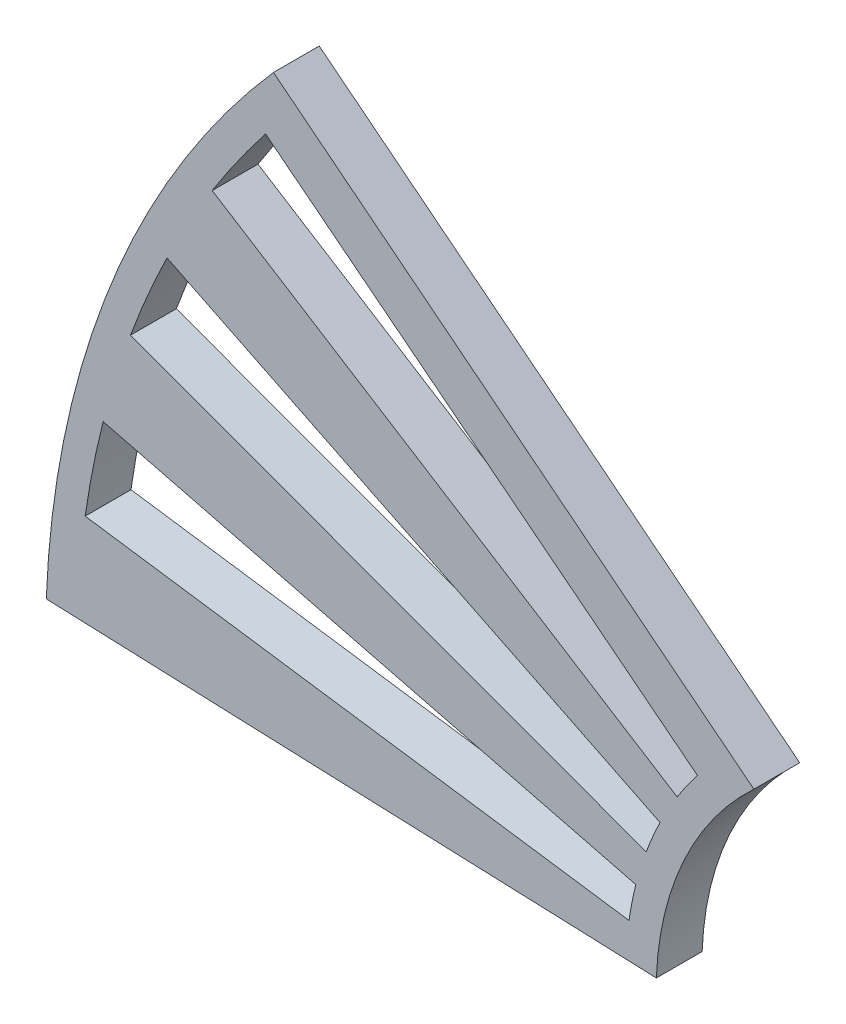
ISO-10303-21;
HEADER;
FILE_DESCRIPTION(('STEP AP214'),'2;1');
FILE_NAME('part.step','',(''),(''),'','','');
FILE_SCHEMA(('AUTOMOTIVE_DESIGN { 1 0 10303 214 1 1 1 1 }'));
ENDSEC;
DATA;
#1=APPLICATION_CONTEXT('core data for automotive mechanical design processes');
#2=APPLICATION_PROTOCOL_DEFINITION('international standard','automotive_design',2000,#1);
#3=PRODUCT_CONTEXT('',#1,'mechanical');
#4=PRODUCT('Part','Part','',(#3));
#5=PRODUCT_RELATED_PRODUCT_CATEGORY('part','',(#4));
#6=PRODUCT_DEFINITION_FORMATION('','',#4);
#7=PRODUCT_DEFINITION_CONTEXT('part definition',#1,'design');
#8=PRODUCT_DEFINITION('design','',#6,#7);
#9=PRODUCT_DEFINITION_SHAPE('','',#8);
#10=(LENGTH_UNIT() NAMED_UNIT(*) SI_UNIT(.MILLI.,.METRE.));
#11=(NAMED_UNIT(*) PLANE_ANGLE_UNIT() SI_UNIT($,.RADIAN.));
#12=(NAMED_UNIT(*) SI_UNIT($,.STERADIAN.) SOLID_ANGLE_UNIT());
#13=UNCERTAINTY_MEASURE_WITH_UNIT(LENGTH_MEASURE(1.E-05),#10,'distance_accuracy_value','');
#14=(GEOMETRIC_REPRESENTATION_CONTEXT(3) GLOBAL_UNCERTAINTY_ASSIGNED_CONTEXT((#13)) GLOBAL_UNIT_ASSIGNED_CONTEXT((#10,
#11,#12)) REPRESENTATION_CONTEXT('',''));
#15=CARTESIAN_POINT('',(0.,0.,0.));
#16=DIRECTION('',(0.,0.,1.));
#17=DIRECTION('',(1.,0.,0.));
#18=AXIS2_PLACEMENT_3D('',#15,#16,#17);
#19=CARTESIAN_POINT('',(0.,0.,3.));
#20=DIRECTION('',(0.,0.,-1.));
#21=DIRECTION('',(-1.,0.,0.));
#22=AXIS2_PLACEMENT_3D('',#19,#20,#21);
#23=CYLINDRICAL_SURFACE('',#22,20.);
#24=CARTESIAN_POINT('',(0.,0.,0.));
#25=DIRECTION('',(0.,0.,1.));
#26=DIRECTION('',(1.,0.,0.));
#27=AXIS2_PLACEMENT_3D('',#24,#25,#26);
#28=CIRCLE('',#27,20.);
#29=CARTESIAN_POINT('',(-13.592462365831,14.671229220262,0.));
#30=VERTEX_POINT('',#29);
#31=CARTESIAN_POINT('',(-19.9854479818915,0.762803358087425,0.));
#32=VERTEX_POINT('',#31);
#33=EDGE_CURVE('E289',#30,#32,#28,.T.);
#34=ORIENTED_EDGE('',*,*,#33,.F.);
#35=DIRECTION('',(0.,0.,-1.));
#36=VECTOR('',#35,1.);
#37=CARTESIAN_POINT('',(-13.592462365831,14.671229220262,3.));
#38=LINE('',#37,#36);
#39=CARTESIAN_POINT('',(-13.592462365831,14.671229220262,3.));
#40=VERTEX_POINT('',#39);
#41=EDGE_CURVE('E11',#40,#30,#38,.T.);
#42=ORIENTED_EDGE('',*,*,#41,.F.);
#43=CARTESIAN_POINT('',(0.,0.,3.));
#44=DIRECTION('',(0.,0.,1.));
#45=DIRECTION('',(1.,0.,0.));
#46=AXIS2_PLACEMENT_3D('',#43,#44,#45);
#47=CIRCLE('',#46,20.);
#48=CARTESIAN_POINT('',(-19.9854479818915,0.762803358087425,3.));
#49=VERTEX_POINT('',#48);
#50=EDGE_CURVE('E290',#40,#49,#47,.T.);
#51=ORIENTED_EDGE('',*,*,#50,.T.);
#52=DIRECTION('',(0.,0.,-1.));
#53=VECTOR('',#52,1.);
#54=CARTESIAN_POINT('',(-19.9854479818915,0.762803358087425,3.));
#55=LINE('',#54,#53);
#56=EDGE_CURVE('E44',#49,#32,#55,.T.);
#57=ORIENTED_EDGE('',*,*,#56,.T.);
#58=EDGE_LOOP('',(#34,#42,#51,#57));
#59=FACE_BOUND('',#58,.T.);
#60=ADVANCED_FACE('F41',(#59),#23,.F.);
#61=CARTESIAN_POINT('',(-13.592462365831,14.671229220262,3.));
#62=DIRECTION('',(-0.620836450086055,-0.783940113940182,0.));
#63=DIRECTION('',(0.783940113940182,-0.620836450086055,0.));
#64=AXIS2_PLACEMENT_3D('',#61,#62,#63);
#65=PLANE('',#64);
#66=DIRECTION('',(-0.783940113940182,0.620836450086055,0.));
#67=VECTOR('',#66,1.);
#68=CARTESIAN_POINT('',(-13.592462365831,14.671229220262,0.));
#69=LINE('',#68,#67);
#70=CARTESIAN_POINT('',(-45.0736727010104,39.6025760430074,0.));
#71=VERTEX_POINT('',#70);
#72=EDGE_CURVE('E295',#30,#71,#69,.T.);
#73=ORIENTED_EDGE('',*,*,#72,.T.);
#74=DIRECTION('',(0.,0.,-1.));
#75=VECTOR('',#74,1.);
#76=CARTESIAN_POINT('',(-45.0736727010104,39.6025760430074,3.));
#77=LINE('',#76,#75);
#78=CARTESIAN_POINT('',(-45.0736727010104,39.6025760430074,3.));
#79=VERTEX_POINT('',#78);
#80=EDGE_CURVE('E50',#79,#71,#77,.T.);
#81=ORIENTED_EDGE('',*,*,#80,.F.);
#82=DIRECTION('',(-0.783940113940182,0.620836450086055,0.));
#83=VECTOR('',#82,1.);
#84=CARTESIAN_POINT('',(-13.592462365831,14.671229220262,3.));
#85=LINE('',#84,#83);
#86=EDGE_CURVE('E302',#40,#79,#85,.T.);
#87=ORIENTED_EDGE('',*,*,#86,.F.);
#88=ORIENTED_EDGE('',*,*,#41,.T.);
#89=EDGE_LOOP('',(#73,#81,#87,#88));
#90=FACE_BOUND('',#89,.T.);
#91=ADVANCED_FACE('F336',(#90),#65,.F.);
#92=CARTESIAN_POINT('',(0.,0.,3.));
#93=DIRECTION('',(0.,0.,-1.));
#94=DIRECTION('',(-1.,0.,0.));
#95=AXIS2_PLACEMENT_3D('',#92,#93,#94);
#96=CYLINDRICAL_SURFACE('',#95,60.);
#97=CARTESIAN_POINT('',(0.,0.,0.));
#98=DIRECTION('',(0.,0.,1.));
#99=DIRECTION('',(1.,0.,0.));
#100=AXIS2_PLACEMENT_3D('',#97,#98,#99);
#101=CIRCLE('',#100,60.);
#102=CARTESIAN_POINT('',(-59.9563439456744,2.28841007426227,0.));
#103=VERTEX_POINT('',#102);
#104=EDGE_CURVE('E312',#71,#103,#101,.T.);
#105=ORIENTED_EDGE('',*,*,#104,.T.);
#106=DIRECTION('',(0.,0.,-1.));
#107=VECTOR('',#106,1.);
#108=CARTESIAN_POINT('',(-59.9563439456744,2.28841007426227,3.));
#109=LINE('',#108,#107);
#110=CARTESIAN_POINT('',(-59.9563439456744,2.28841007426227,3.));
#111=VERTEX_POINT('',#110);
#112=EDGE_CURVE('E320',#111,#103,#109,.T.);
#113=ORIENTED_EDGE('',*,*,#112,.F.);
#114=CARTESIAN_POINT('',(0.,0.,3.));
#115=DIRECTION('',(0.,0.,1.));
#116=DIRECTION('',(1.,0.,0.));
#117=AXIS2_PLACEMENT_3D('',#114,#115,#116);
#118=CIRCLE('',#117,60.);
#119=EDGE_CURVE('E299',#79,#111,#118,.T.);
#120=ORIENTED_EDGE('',*,*,#119,.F.);
#121=ORIENTED_EDGE('',*,*,#80,.T.);
#122=EDGE_LOOP('',(#105,#113,#120,#121));
#123=FACE_BOUND('',#122,.T.);
#124=ADVANCED_FACE('F340',(#123),#96,.T.);
#125=CARTESIAN_POINT('',(-19.9854479818915,0.762803358087425,3.));
#126=DIRECTION('',(-0.0381401679043713,-0.999272399094574,0.));
#127=DIRECTION('',(0.999272399094575,-0.0381401679043713,0.));
#128=AXIS2_PLACEMENT_3D('',#125,#126,#127);
#129=PLANE('',#128);
#130=DIRECTION('',(-0.999272399094574,0.0381401679043713,0.));
#131=VECTOR('',#130,1.);
#132=CARTESIAN_POINT('',(-19.9854479818915,0.762803358087425,0.));
#133=LINE('',#132,#131);
#134=EDGE_CURVE('E308',#32,#103,#133,.T.);
#135=ORIENTED_EDGE('',*,*,#134,.F.);
#136=ORIENTED_EDGE('',*,*,#56,.F.);
#137=DIRECTION('',(-0.999272399094574,0.0381401679043713,0.));
#138=VECTOR('',#137,1.);
#139=CARTESIAN_POINT('',(-19.9854479818915,0.762803358087425,3.));
#140=LINE('',#139,#138);
#141=EDGE_CURVE('E294',#49,#111,#140,.T.);
#142=ORIENTED_EDGE('',*,*,#141,.T.);
#143=ORIENTED_EDGE('',*,*,#112,.T.);
#144=EDGE_LOOP('',(#135,#136,#142,#143));
#145=FACE_BOUND('',#144,.T.);
#146=ADVANCED_FACE('F330',(#145),#129,.T.);
#147=CARTESIAN_POINT('',(0.,0.,3.));
#148=DIRECTION('',(0.,0.,1.));
#149=DIRECTION('',(1.,0.,0.));
#150=AXIS2_PLACEMENT_3D('',#147,#148,#149);
#151=PLANE('',#150);
#152=CARTESIAN_POINT('',(0.,0.,3.));
#153=DIRECTION('',(0.,0.,1.));
#154=DIRECTION('',(1.,0.,0.));
#155=AXIS2_PLACEMENT_3D('',#152,#153,#154);
#156=CIRCLE('',#155,58.);
#157=CARTESIAN_POINT('',(-52.0473299222807,25.59444173959,3.));
#158=VERTEX_POINT('',#157);
#159=CARTESIAN_POINT('',(-54.4375568663973,20.0138052957893,3.));
#160=VERTEX_POINT('',#159);
#161=EDGE_CURVE('E58',#158,#160,#156,.T.);
#162=ORIENTED_EDGE('',*,*,#161,.F.);
#163=DIRECTION('',(-0.897367757280701,0.441283478268794,0.));
#164=VECTOR('',#163,1.);
#165=CARTESIAN_POINT('',(-52.0473299222807,25.59444173959,3.));
#166=LINE('',#165,#164);
#167=CARTESIAN_POINT('',(-19.7420906601754,9.70823652191346,3.));
#168=VERTEX_POINT('',#167);
#169=EDGE_CURVE('E226',#168,#158,#166,.T.);
#170=ORIENTED_EDGE('',*,*,#169,.F.);
#171=CARTESIAN_POINT('',(0.,0.,3.));
#172=DIRECTION('',(0.,0.,-1.));
#173=DIRECTION('',(-1.,0.,0.));
#174=AXIS2_PLACEMENT_3D('',#171,#172,#173);
#175=CIRCLE('',#174,22.);
#176=CARTESIAN_POINT('',(-20.6487284665645,7.59144338805802,3.));
#177=VERTEX_POINT('',#176);
#178=EDGE_CURVE('E222',#177,#168,#175,.T.);
#179=ORIENTED_EDGE('',*,*,#178,.F.);
#180=DIRECTION('',(0.938578566662022,-0.345065608548092,0.));
#181=VECTOR('',#180,1.);
#182=CARTESIAN_POINT('',(-20.6487284665645,7.59144338805802,3.));
#183=LINE('',#182,#181);
#184=EDGE_CURVE('E218',#160,#177,#183,.T.);
#185=ORIENTED_EDGE('',*,*,#184,.F.);
#186=EDGE_LOOP('',(#162,#170,#179,#185));
#187=FACE_BOUND('',#186,.T.);
#188=CARTESIAN_POINT('',(0.,0.,3.));
#189=DIRECTION('',(0.,0.,1.));
#190=DIRECTION('',(1.,0.,0.));
#191=AXIS2_PLACEMENT_3D('',#188,#189,#190);
#192=CIRCLE('',#191,58.);
#193=CARTESIAN_POINT('',(-45.5885872304648,35.8563901463923,3.));
#194=VERTEX_POINT('',#193);
#195=CARTESIAN_POINT('',(-49.0868615399316,30.8946601237104,3.));
#196=VERTEX_POINT('',#195);
#197=EDGE_CURVE('E66',#194,#196,#192,.T.);
#198=ORIENTED_EDGE('',*,*,#197,.F.);
#199=DIRECTION('',(-0.786010124663187,0.618213623213661,0.));
#200=VECTOR('',#199,1.);
#201=CARTESIAN_POINT('',(-45.5885872304648,35.8563901463923,3.));
#202=LINE('',#201,#200);
#203=CARTESIAN_POINT('',(-17.2922227425901,13.6006997107005,3.));
#204=VERTEX_POINT('',#203);
#205=EDGE_CURVE('E164',#204,#194,#202,.T.);
#206=ORIENTED_EDGE('',*,*,#205,.F.);
#207=CARTESIAN_POINT('',(0.,0.,3.));
#208=DIRECTION('',(0.,0.,-1.));
#209=DIRECTION('',(-1.,0.,0.));
#210=AXIS2_PLACEMENT_3D('',#207,#208,#209);
#211=CIRCLE('',#210,22.);
#212=CARTESIAN_POINT('',(-18.6191543772154,11.7186641848557,3.));
#213=VERTEX_POINT('',#212);
#214=EDGE_CURVE('E192',#213,#204,#211,.T.);
#215=ORIENTED_EDGE('',*,*,#214,.F.);
#216=DIRECTION('',(0.846325198964338,-0.532666553857077,0.));
#217=VECTOR('',#216,1.);
#218=CARTESIAN_POINT('',(-18.6191543772154,11.7186641848557,3.));
#219=LINE('',#218,#217);
#220=EDGE_CURVE('E184',#196,#213,#219,.T.);
#221=ORIENTED_EDGE('',*,*,#220,.F.);
#222=EDGE_LOOP('',(#198,#206,#215,#221));
#223=FACE_BOUND('',#222,.T.);
#224=CARTESIAN_POINT('',(0.,0.,3.));
#225=DIRECTION('',(0.,0.,-1.));
#226=DIRECTION('',(-1.,0.,0.));
#227=AXIS2_PLACEMENT_3D('',#224,#225,#226);
#228=CIRCLE('',#227,22.);
#229=CARTESIAN_POINT('',(-21.7758540383323,3.13244008741524,3.));
#230=VERTEX_POINT('',#229);
#231=CARTESIAN_POINT('',(-21.3291344828496,5.39147681183139,3.));
#232=VERTEX_POINT('',#231);
#233=EDGE_CURVE('E257',#230,#232,#228,.T.);
#234=ORIENTED_EDGE('',*,*,#233,.F.);
#235=DIRECTION('',(0.989811547196924,-0.142383640337056,0.));
#236=VECTOR('',#235,1.);
#237=CARTESIAN_POINT('',(-21.7758540383323,3.13244008741524,3.));
#238=LINE('',#237,#236);
#239=CARTESIAN_POINT('',(-57.4090697374216,8.25825113954927,3.));
#240=VERTEX_POINT('',#239);
#241=EDGE_CURVE('E268',#240,#230,#238,.T.);
#242=ORIENTED_EDGE('',*,*,#241,.F.);
#243=CARTESIAN_POINT('',(0.,0.,3.));
#244=DIRECTION('',(0.,0.,1.));
#245=DIRECTION('',(1.,0.,0.));
#246=AXIS2_PLACEMENT_3D('',#243,#244,#245);
#247=CIRCLE('',#246,58.);
#248=CARTESIAN_POINT('',(-56.2313545456944,14.21389341301,3.));
#249=VERTEX_POINT('',#248);
#250=EDGE_CURVE('E264',#249,#240,#247,.T.);
#251=ORIENTED_EDGE('',*,*,#250,.F.);
#252=DIRECTION('',(-0.969506112856801,0.245067127810517,0.));
#253=VECTOR('',#252,1.);
#254=CARTESIAN_POINT('',(-56.2313545456944,14.21389341301,3.));
#255=LINE('',#254,#253);
#256=EDGE_CURVE('E260',#232,#249,#255,.T.);
#257=ORIENTED_EDGE('',*,*,#256,.F.);
#258=EDGE_LOOP('',(#234,#242,#251,#257));
#259=FACE_BOUND('',#258,.T.);
#260=ORIENTED_EDGE('',*,*,#50,.F.);
#261=ORIENTED_EDGE('',*,*,#86,.T.);
#262=ORIENTED_EDGE('',*,*,#119,.T.);
#263=ORIENTED_EDGE('',*,*,#141,.F.);
#264=EDGE_LOOP('',(#260,#261,#262,#263));
#265=FACE_BOUND('',#264,.T.);
#266=ADVANCED_FACE('F342',(#187,#223,#259,#265),#151,.T.);
#267=CARTESIAN_POINT('',(0.,0.,0.));
#268=DIRECTION('',(0.,0.,1.));
#269=DIRECTION('',(1.,0.,0.));
#270=AXIS2_PLACEMENT_3D('',#267,#268,#269);
#271=PLANE('',#270);
#272=DIRECTION('',(0.897367757280701,-0.441283478268794,0.));
#273=VECTOR('',#272,1.);
#274=CARTESIAN_POINT('',(-52.0473299222807,25.59444173959,0.));
#275=LINE('',#274,#273);
#276=CARTESIAN_POINT('',(-52.0473299222807,25.59444173959,0.));
#277=VERTEX_POINT('',#276);
#278=CARTESIAN_POINT('',(-19.7420906601754,9.70823652191346,0.));
#279=VERTEX_POINT('',#278);
#280=EDGE_CURVE('E208',#277,#279,#275,.T.);
#281=ORIENTED_EDGE('',*,*,#280,.F.);
#282=CARTESIAN_POINT('',(0.,0.,0.));
#283=DIRECTION('',(0.,0.,1.));
#284=DIRECTION('',(1.,0.,0.));
#285=AXIS2_PLACEMENT_3D('',#282,#283,#284);
#286=CIRCLE('',#285,58.);
#287=CARTESIAN_POINT('',(-54.4375568663973,20.0138052957893,0.));
#288=VERTEX_POINT('',#287);
#289=EDGE_CURVE('E212',#288,#277,#286,.F.);
#290=ORIENTED_EDGE('',*,*,#289,.F.);
#291=DIRECTION('',(-0.938578566662022,0.345065608548092,0.));
#292=VECTOR('',#291,1.);
#293=CARTESIAN_POINT('',(-20.6487284665645,7.59144338805802,0.));
#294=LINE('',#293,#292);
#295=CARTESIAN_POINT('',(-20.6487284665645,7.59144338805802,0.));
#296=VERTEX_POINT('',#295);
#297=EDGE_CURVE('E234',#296,#288,#294,.T.);
#298=ORIENTED_EDGE('',*,*,#297,.F.);
#299=CARTESIAN_POINT('',(0.,0.,0.));
#300=DIRECTION('',(0.,0.,1.));
#301=DIRECTION('',(1.,0.,0.));
#302=AXIS2_PLACEMENT_3D('',#299,#300,#301);
#303=CIRCLE('',#302,22.);
#304=EDGE_CURVE('E173',#279,#296,#303,.T.);
#305=ORIENTED_EDGE('',*,*,#304,.F.);
#306=EDGE_LOOP('',(#281,#290,#298,#305));
#307=FACE_BOUND('',#306,.T.);
#308=DIRECTION('',(0.786010124663187,-0.618213623213661,0.));
#309=VECTOR('',#308,1.);
#310=CARTESIAN_POINT('',(-45.5885872304648,35.8563901463923,0.));
#311=LINE('',#310,#309);
#312=CARTESIAN_POINT('',(-45.5885872304648,35.8563901463923,0.));
#313=VERTEX_POINT('',#312);
#314=CARTESIAN_POINT('',(-17.2922227425901,13.6006997107005,0.));
#315=VERTEX_POINT('',#314);
#316=EDGE_CURVE('E179',#313,#315,#311,.T.);
#317=ORIENTED_EDGE('',*,*,#316,.F.);
#318=CARTESIAN_POINT('',(0.,0.,0.));
#319=DIRECTION('',(0.,0.,1.));
#320=DIRECTION('',(1.,0.,0.));
#321=AXIS2_PLACEMENT_3D('',#318,#319,#320);
#322=CIRCLE('',#321,58.);
#323=CARTESIAN_POINT('',(-49.0868615399316,30.8946601237105,0.));
#324=VERTEX_POINT('',#323);
#325=EDGE_CURVE('E157',#324,#313,#322,.F.);
#326=ORIENTED_EDGE('',*,*,#325,.F.);
#327=DIRECTION('',(-0.846325198964338,0.532666553857077,0.));
#328=VECTOR('',#327,1.);
#329=CARTESIAN_POINT('',(-18.6191543772154,11.7186641848557,0.));
#330=LINE('',#329,#328);
#331=CARTESIAN_POINT('',(-18.6191543772154,11.7186641848557,0.));
#332=VERTEX_POINT('',#331);
#333=EDGE_CURVE('E168',#332,#324,#330,.T.);
#334=ORIENTED_EDGE('',*,*,#333,.F.);
#335=CARTESIAN_POINT('',(0.,0.,0.));
#336=DIRECTION('',(0.,0.,1.));
#337=DIRECTION('',(1.,0.,0.));
#338=AXIS2_PLACEMENT_3D('',#335,#336,#337);
#339=CIRCLE('',#338,22.);
#340=EDGE_CURVE('E186',#315,#332,#339,.T.);
#341=ORIENTED_EDGE('',*,*,#340,.F.);
#342=EDGE_LOOP('',(#317,#326,#334,#341));
#343=FACE_BOUND('',#342,.T.);
#344=DIRECTION('',(-0.989811547196924,0.142383640337056,0.));
#345=VECTOR('',#344,1.);
#346=CARTESIAN_POINT('',(-21.7758540383323,3.13244008741524,0.));
#347=LINE('',#346,#345);
#348=CARTESIAN_POINT('',(-21.7758540383323,3.13244008741524,0.));
#349=VERTEX_POINT('',#348);
#350=CARTESIAN_POINT('',(-57.4090697374216,8.25825113954927,0.));
#351=VERTEX_POINT('',#350);
#352=EDGE_CURVE('E249',#349,#351,#347,.T.);
#353=ORIENTED_EDGE('',*,*,#352,.F.);
#354=CARTESIAN_POINT('',(0.,0.,0.));
#355=DIRECTION('',(0.,0.,1.));
#356=DIRECTION('',(1.,0.,0.));
#357=AXIS2_PLACEMENT_3D('',#354,#355,#356);
#358=CIRCLE('',#357,22.);
#359=CARTESIAN_POINT('',(-21.3291344828496,5.39147681183138,0.));
#360=VERTEX_POINT('',#359);
#361=EDGE_CURVE('E253',#360,#349,#358,.T.);
#362=ORIENTED_EDGE('',*,*,#361,.F.);
#363=DIRECTION('',(0.969506112856801,-0.245067127810517,0.));
#364=VECTOR('',#363,1.);
#365=CARTESIAN_POINT('',(-56.2313545456944,14.21389341301,0.));
#366=LINE('',#365,#364);
#367=CARTESIAN_POINT('',(-56.2313545456944,14.21389341301,0.));
#368=VERTEX_POINT('',#367);
#369=EDGE_CURVE('E276',#368,#360,#366,.T.);
#370=ORIENTED_EDGE('',*,*,#369,.F.);
#371=CARTESIAN_POINT('',(0.,0.,0.));
#372=DIRECTION('',(0.,0.,1.));
#373=DIRECTION('',(1.,0.,0.));
#374=AXIS2_PLACEMENT_3D('',#371,#372,#373);
#375=CIRCLE('',#374,58.);
#376=EDGE_CURVE('E246',#351,#368,#375,.F.);
#377=ORIENTED_EDGE('',*,*,#376,.F.);
#378=EDGE_LOOP('',(#353,#362,#370,#377));
#379=FACE_BOUND('',#378,.T.);
#380=ORIENTED_EDGE('',*,*,#33,.T.);
#381=ORIENTED_EDGE('',*,*,#134,.T.);
#382=ORIENTED_EDGE('',*,*,#104,.F.);
#383=ORIENTED_EDGE('',*,*,#72,.F.);
#384=EDGE_LOOP('',(#380,#381,#382,#383));
#385=FACE_BOUND('',#384,.T.);
#386=ADVANCED_FACE('F176',(#307,#343,#379,#385),#271,.F.);
#387=CARTESIAN_POINT('',(0.,0.,-0.00100000000000013));
#388=DIRECTION('',(0.,0.,1.));
#389=DIRECTION('',(1.,0.,0.));
#390=AXIS2_PLACEMENT_3D('',#387,#388,#389);
#391=CYLINDRICAL_SURFACE('',#390,22.);
#392=ORIENTED_EDGE('',*,*,#361,.T.);
#393=DIRECTION('',(0.,0.,1.));
#394=VECTOR('',#393,1.);
#395=CARTESIAN_POINT('',(-21.7758540383323,3.13244008741524,-0.00100000000000013));
#396=LINE('',#395,#394);
#397=EDGE_CURVE('E273',#349,#230,#396,.T.);
#398=ORIENTED_EDGE('',*,*,#397,.T.);
#399=ORIENTED_EDGE('',*,*,#233,.T.);
#400=DIRECTION('',(0.,0.,1.));
#401=VECTOR('',#400,1.);
#402=CARTESIAN_POINT('',(-21.3291344828496,5.39147681183138,-0.00100000000000013));
#403=LINE('',#402,#401);
#404=EDGE_CURVE('E272',#360,#232,#403,.T.);
#405=ORIENTED_EDGE('',*,*,#404,.F.);
#406=EDGE_LOOP('',(#392,#398,#399,#405));
#407=FACE_BOUND('',#406,.T.);
#408=ADVANCED_FACE('F350',(#407),#391,.T.);
#409=CARTESIAN_POINT('',(-21.7758540383323,3.13244008741524,-0.00100000000000013));
#410=DIRECTION('',(-0.142383640337056,-0.989811547196924,0.));
#411=DIRECTION('',(0.989811547196924,-0.142383640337056,0.));
#412=AXIS2_PLACEMENT_3D('',#409,#410,#411);
#413=PLANE('',#412);
#414=ORIENTED_EDGE('',*,*,#352,.T.);
#415=DIRECTION('',(0.,0.,1.));
#416=VECTOR('',#415,1.);
#417=CARTESIAN_POINT('',(-57.4090697374216,8.25825113954927,-0.00100000000000013));
#418=LINE('',#417,#416);
#419=EDGE_CURVE('E277',#351,#240,#418,.T.);
#420=ORIENTED_EDGE('',*,*,#419,.T.);
#421=ORIENTED_EDGE('',*,*,#241,.T.);
#422=ORIENTED_EDGE('',*,*,#397,.F.);
#423=EDGE_LOOP('',(#414,#420,#421,#422));
#424=FACE_BOUND('',#423,.T.);
#425=ADVANCED_FACE('F389',(#424),#413,.F.);
#426=CARTESIAN_POINT('',(0.,0.,-0.00100000000000013));
#427=DIRECTION('',(0.,0.,1.));
#428=DIRECTION('',(1.,0.,0.));
#429=AXIS2_PLACEMENT_3D('',#426,#427,#428);
#430=CYLINDRICAL_SURFACE('',#429,58.);
#431=ORIENTED_EDGE('',*,*,#376,.T.);
#432=DIRECTION('',(0.,0.,1.));
#433=VECTOR('',#432,1.);
#434=CARTESIAN_POINT('',(-56.2313545456944,14.21389341301,-0.00100000000000013));
#435=LINE('',#434,#433);
#436=EDGE_CURVE('E280',#368,#249,#435,.T.);
#437=ORIENTED_EDGE('',*,*,#436,.T.);
#438=ORIENTED_EDGE('',*,*,#250,.T.);
#439=ORIENTED_EDGE('',*,*,#419,.F.);
#440=EDGE_LOOP('',(#431,#437,#438,#439));
#441=FACE_BOUND('',#440,.T.);
#442=ADVANCED_FACE('F398',(#441),#430,.F.);
#443=CARTESIAN_POINT('',(-56.2313545456944,14.21389341301,-0.00100000000000013));
#444=DIRECTION('',(0.245067127810517,0.969506112856801,0.));
#445=DIRECTION('',(-0.969506112856801,0.245067127810517,0.));
#446=AXIS2_PLACEMENT_3D('',#443,#444,#445);
#447=PLANE('',#446);
#448=ORIENTED_EDGE('',*,*,#369,.T.);
#449=ORIENTED_EDGE('',*,*,#404,.T.);
#450=ORIENTED_EDGE('',*,*,#256,.T.);
#451=ORIENTED_EDGE('',*,*,#436,.F.);
#452=EDGE_LOOP('',(#448,#449,#450,#451));
#453=FACE_BOUND('',#452,.T.);
#454=ADVANCED_FACE('F408',(#453),#447,.F.);
#455=CARTESIAN_POINT('',(0.,0.,-0.00100000000000013));
#456=DIRECTION('',(0.,0.,1.));
#457=DIRECTION('',(1.,0.,0.));
#458=AXIS2_PLACEMENT_3D('',#455,#456,#457);
#459=CYLINDRICAL_SURFACE('',#458,58.);
#460=ORIENTED_EDGE('',*,*,#325,.T.);
#461=DIRECTION('',(0.,0.,1.));
#462=VECTOR('',#461,1.);
#463=CARTESIAN_POINT('',(-45.5885872304648,35.8563901463923,-0.00100000000000013));
#464=LINE('',#463,#462);
#465=EDGE_CURVE('E174',#313,#194,#464,.T.);
#466=ORIENTED_EDGE('',*,*,#465,.T.);
#467=ORIENTED_EDGE('',*,*,#197,.T.);
#468=DIRECTION('',(0.,0.,1.));
#469=VECTOR('',#468,1.);
#470=CARTESIAN_POINT('',(-49.0868615399316,30.8946601237105,-0.00100000000000013));
#471=LINE('',#470,#469);
#472=EDGE_CURVE('E153',#324,#196,#471,.T.);
#473=ORIENTED_EDGE('',*,*,#472,.F.);
#474=EDGE_LOOP('',(#460,#466,#467,#473));
#475=FACE_BOUND('',#474,.T.);
#476=ADVANCED_FACE('F155',(#475),#459,.F.);
#477=CARTESIAN_POINT('',(-45.5885872304648,35.8563901463923,-0.00100000000000013));
#478=DIRECTION('',(0.618213623213661,0.786010124663186,0.));
#479=DIRECTION('',(-0.786010124663187,0.618213623213661,0.));
#480=AXIS2_PLACEMENT_3D('',#477,#478,#479);
#481=PLANE('',#480);
#482=ORIENTED_EDGE('',*,*,#316,.T.);
#483=DIRECTION('',(0.,0.,1.));
#484=VECTOR('',#483,1.);
#485=CARTESIAN_POINT('',(-17.2922227425901,13.6006997107005,-0.00100000000000013));
#486=LINE('',#485,#484);
#487=EDGE_CURVE('E201',#315,#204,#486,.T.);
#488=ORIENTED_EDGE('',*,*,#487,.T.);
#489=ORIENTED_EDGE('',*,*,#205,.T.);
#490=ORIENTED_EDGE('',*,*,#465,.F.);
#491=EDGE_LOOP('',(#482,#488,#489,#490));
#492=FACE_BOUND('',#491,.T.);
#493=ADVANCED_FACE('F427',(#492),#481,.F.);
#494=CARTESIAN_POINT('',(0.,0.,-0.00100000000000013));
#495=DIRECTION('',(0.,0.,1.));
#496=DIRECTION('',(1.,0.,0.));
#497=AXIS2_PLACEMENT_3D('',#494,#495,#496);
#498=CYLINDRICAL_SURFACE('',#497,22.);
#499=ORIENTED_EDGE('',*,*,#340,.T.);
#500=DIRECTION('',(0.,0.,1.));
#501=VECTOR('',#500,1.);
#502=CARTESIAN_POINT('',(-18.6191543772154,11.7186641848557,-0.00100000000000013));
#503=LINE('',#502,#501);
#504=EDGE_CURVE('E163',#332,#213,#503,.T.);
#505=ORIENTED_EDGE('',*,*,#504,.T.);
#506=ORIENTED_EDGE('',*,*,#214,.T.);
#507=ORIENTED_EDGE('',*,*,#487,.F.);
#508=EDGE_LOOP('',(#499,#505,#506,#507));
#509=FACE_BOUND('',#508,.T.);
#510=ADVANCED_FACE('F436',(#509),#498,.T.);
#511=CARTESIAN_POINT('',(-18.6191543772154,11.7186641848557,-0.00100000000000013));
#512=DIRECTION('',(-0.532666553857077,-0.846325198964338,0.));
#513=DIRECTION('',(0.846325198964338,-0.532666553857077,0.));
#514=AXIS2_PLACEMENT_3D('',#511,#512,#513);
#515=PLANE('',#514);
#516=ORIENTED_EDGE('',*,*,#333,.T.);
#517=ORIENTED_EDGE('',*,*,#472,.T.);
#518=ORIENTED_EDGE('',*,*,#220,.T.);
#519=ORIENTED_EDGE('',*,*,#504,.F.);
#520=EDGE_LOOP('',(#516,#517,#518,#519));
#521=FACE_BOUND('',#520,.T.);
#522=ADVANCED_FACE('F169',(#521),#515,.F.);
#523=CARTESIAN_POINT('',(0.,0.,-0.00100000000000013));
#524=DIRECTION('',(0.,0.,1.));
#525=DIRECTION('',(1.,0.,0.));
#526=AXIS2_PLACEMENT_3D('',#523,#524,#525);
#527=CYLINDRICAL_SURFACE('',#526,58.);
#528=ORIENTED_EDGE('',*,*,#289,.T.);
#529=DIRECTION('',(0.,0.,1.));
#530=VECTOR('',#529,1.);
#531=CARTESIAN_POINT('',(-52.0473299222807,25.59444173959,-0.00100000000000013));
#532=LINE('',#531,#530);
#533=EDGE_CURVE('E231',#277,#158,#532,.T.);
#534=ORIENTED_EDGE('',*,*,#533,.T.);
#535=ORIENTED_EDGE('',*,*,#161,.T.);
#536=DIRECTION('',(0.,0.,1.));
#537=VECTOR('',#536,1.);
#538=CARTESIAN_POINT('',(-54.4375568663973,20.0138052957893,-0.00100000000000013));
#539=LINE('',#538,#537);
#540=EDGE_CURVE('E230',#288,#160,#539,.T.);
#541=ORIENTED_EDGE('',*,*,#540,.F.);
#542=EDGE_LOOP('',(#528,#534,#535,#541));
#543=FACE_BOUND('',#542,.T.);
#544=ADVANCED_FACE('F455',(#543),#527,.F.);
#545=CARTESIAN_POINT('',(-52.0473299222807,25.59444173959,-0.00100000000000013));
#546=DIRECTION('',(0.441283478268794,0.897367757280701,0.));
#547=DIRECTION('',(-0.897367757280701,0.441283478268794,0.));
#548=AXIS2_PLACEMENT_3D('',#545,#546,#547);
#549=PLANE('',#548);
#550=ORIENTED_EDGE('',*,*,#280,.T.);
#551=DIRECTION('',(0.,0.,1.));
#552=VECTOR('',#551,1.);
#553=CARTESIAN_POINT('',(-19.7420906601754,9.70823652191346,-0.00100000000000013));
#554=LINE('',#553,#552);
#555=EDGE_CURVE('E235',#279,#168,#554,.T.);
#556=ORIENTED_EDGE('',*,*,#555,.T.);
#557=ORIENTED_EDGE('',*,*,#169,.T.);
#558=ORIENTED_EDGE('',*,*,#533,.F.);
#559=EDGE_LOOP('',(#550,#556,#557,#558));
#560=FACE_BOUND('',#559,.T.);
#561=ADVANCED_FACE('F464',(#560),#549,.F.);
#562=CARTESIAN_POINT('',(0.,0.,-0.00100000000000013));
#563=DIRECTION('',(0.,0.,1.));
#564=DIRECTION('',(1.,0.,0.));
#565=AXIS2_PLACEMENT_3D('',#562,#563,#564);
#566=CYLINDRICAL_SURFACE('',#565,22.);
#567=ORIENTED_EDGE('',*,*,#304,.T.);
#568=DIRECTION('',(0.,0.,1.));
#569=VECTOR('',#568,1.);
#570=CARTESIAN_POINT('',(-20.6487284665645,7.59144338805802,-0.00100000000000013));
#571=LINE('',#570,#569);
#572=EDGE_CURVE('E238',#296,#177,#571,.T.);
#573=ORIENTED_EDGE('',*,*,#572,.T.);
#574=ORIENTED_EDGE('',*,*,#178,.T.);
#575=ORIENTED_EDGE('',*,*,#555,.F.);
#576=EDGE_LOOP('',(#567,#573,#574,#575));
#577=FACE_BOUND('',#576,.T.);
#578=ADVANCED_FACE('F473',(#577),#566,.T.);
#579=CARTESIAN_POINT('',(-20.6487284665645,7.59144338805802,-0.00100000000000013));
#580=DIRECTION('',(-0.345065608548092,-0.938578566662022,0.));
#581=DIRECTION('',(0.938578566662022,-0.345065608548092,0.));
#582=AXIS2_PLACEMENT_3D('',#579,#580,#581);
#583=PLANE('',#582);
#584=ORIENTED_EDGE('',*,*,#297,.T.);
#585=ORIENTED_EDGE('',*,*,#540,.T.);
#586=ORIENTED_EDGE('',*,*,#184,.T.);
#587=ORIENTED_EDGE('',*,*,#572,.F.);
#588=EDGE_LOOP('',(#584,#585,#586,#587));
#589=FACE_BOUND('',#588,.T.);
#590=ADVANCED_FACE('F483',(#589),#583,.F.);
#591=CLOSED_SHELL('',(#60,#91,#124,#146,#266,#386,#408,#425,#442,#454,#476,#493,#510,#522,#544,
#561,#578,#590));
#592=MANIFOLD_SOLID_BREP('B2',#591);
#593=ADVANCED_BREP_SHAPE_REPRESENTATION('',(#18,#592),#14);
#594=SHAPE_DEFINITION_REPRESENTATION(#9,#593);
ENDSEC;
END-ISO-10303-21;
